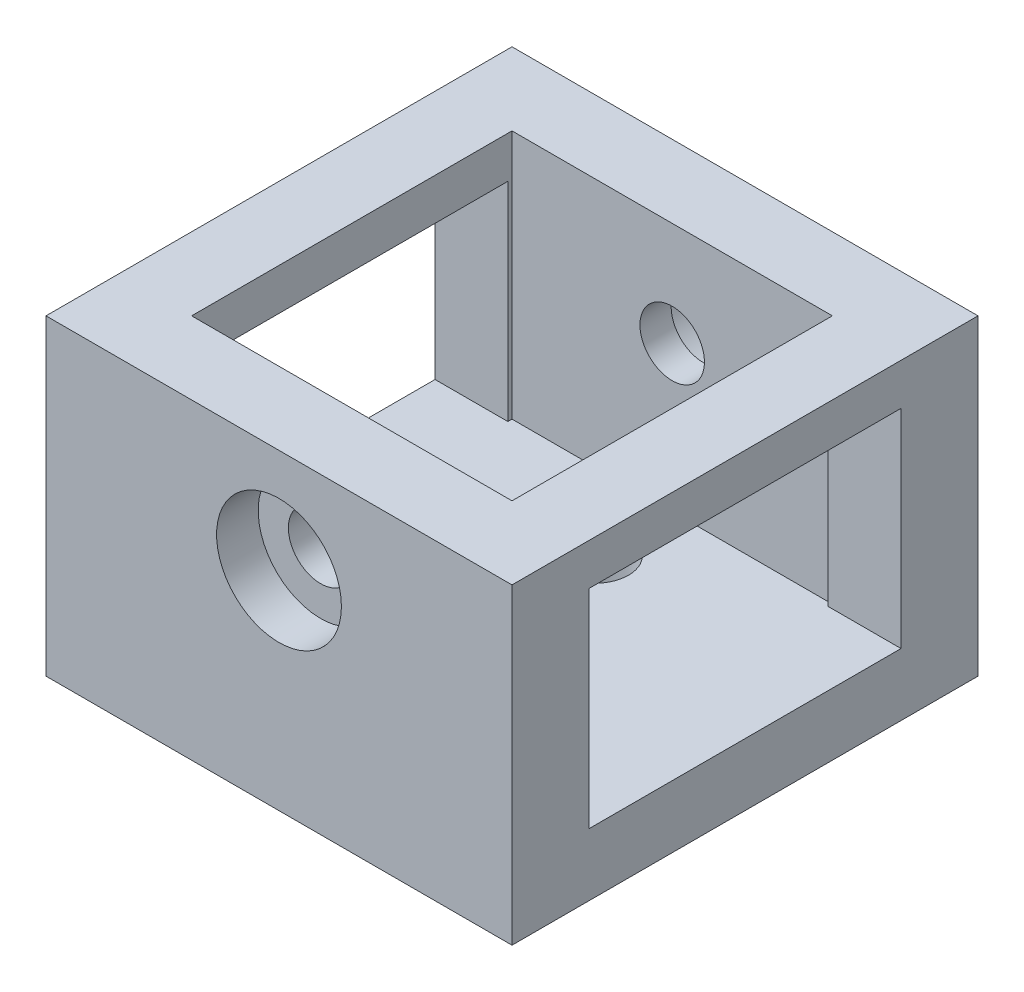
ISO-10303-21;
HEADER;
FILE_DESCRIPTION(('STEP AP214'),'2;1');
FILE_NAME('part.step','',(''),(''),'','','');
FILE_SCHEMA(('AUTOMOTIVE_DESIGN { 1 0 10303 214 1 1 1 1 }'));
ENDSEC;
DATA;
#1=APPLICATION_CONTEXT('core data for automotive mechanical design processes');
#2=APPLICATION_PROTOCOL_DEFINITION('international standard','automotive_design',2000,#1);
#3=PRODUCT_CONTEXT('',#1,'mechanical');
#4=PRODUCT('Part','Part','',(#3));
#5=PRODUCT_RELATED_PRODUCT_CATEGORY('part','',(#4));
#6=PRODUCT_DEFINITION_FORMATION('','',#4);
#7=PRODUCT_DEFINITION_CONTEXT('part definition',#1,'design');
#8=PRODUCT_DEFINITION('design','',#6,#7);
#9=PRODUCT_DEFINITION_SHAPE('','',#8);
#10=(LENGTH_UNIT() NAMED_UNIT(*) SI_UNIT(.MILLI.,.METRE.));
#11=(NAMED_UNIT(*) PLANE_ANGLE_UNIT() SI_UNIT($,.RADIAN.));
#12=(NAMED_UNIT(*) SI_UNIT($,.STERADIAN.) SOLID_ANGLE_UNIT());
#13=UNCERTAINTY_MEASURE_WITH_UNIT(LENGTH_MEASURE(1.E-05),#10,'distance_accuracy_value','');
#14=(GEOMETRIC_REPRESENTATION_CONTEXT(3) GLOBAL_UNCERTAINTY_ASSIGNED_CONTEXT((#13)) GLOBAL_UNIT_ASSIGNED_CONTEXT((#10,
#11,#12)) REPRESENTATION_CONTEXT('',''));
#15=CARTESIAN_POINT('',(0.,0.,0.));
#16=DIRECTION('',(0.,0.,1.));
#17=DIRECTION('',(1.,0.,0.));
#18=AXIS2_PLACEMENT_3D('',#15,#16,#17);
#19=CARTESIAN_POINT('',(0.,10.,11.2));
#20=DIRECTION('',(0.,0.,-1.));
#21=DIRECTION('',(-1.,0.,0.));
#22=AXIS2_PLACEMENT_3D('',#19,#20,#21);
#23=CYLINDRICAL_SURFACE('',#22,1.55);
#24=CARTESIAN_POINT('',(0.,10.,7.7));
#25=DIRECTION('',(0.,0.,1.));
#26=DIRECTION('',(1.,0.,0.));
#27=AXIS2_PLACEMENT_3D('',#24,#25,#26);
#28=CIRCLE('',#27,1.55);
#29=CARTESIAN_POINT('',(1.55,10.,7.7));
#30=VERTEX_POINT('',#29);
#31=EDGE_CURVE('E231',#30,#30,#28,.T.);
#32=ORIENTED_EDGE('',*,*,#31,.F.);
#33=EDGE_LOOP('',(#32));
#34=FACE_BOUND('',#33,.T.);
#35=CARTESIAN_POINT('',(0.,10.,9.2));
#36=DIRECTION('',(0.,0.,1.));
#37=DIRECTION('',(1.,0.,0.));
#38=AXIS2_PLACEMENT_3D('',#35,#36,#37);
#39=CIRCLE('',#38,1.55);
#40=CARTESIAN_POINT('',(1.55,10.,9.2));
#41=VERTEX_POINT('',#40);
#42=EDGE_CURVE('E40',#41,#41,#39,.F.);
#43=ORIENTED_EDGE('',*,*,#42,.F.);
#44=EDGE_LOOP('',(#43));
#45=FACE_BOUND('',#44,.T.);
#46=ADVANCED_FACE('F36',(#34,#45),#23,.F.);
#47=CARTESIAN_POINT('',(0.,10.,-7.7));
#48=DIRECTION('',(0.,0.,-1.));
#49=DIRECTION('',(-1.,0.,0.));
#50=AXIS2_PLACEMENT_3D('',#47,#48,#49);
#51=CIRCLE('',#50,1.55);
#52=CARTESIAN_POINT('',(-1.55,10.,-7.7));
#53=VERTEX_POINT('',#52);
#54=EDGE_CURVE('E228',#53,#53,#51,.T.);
#55=ORIENTED_EDGE('',*,*,#54,.F.);
#56=EDGE_LOOP('',(#55));
#57=FACE_BOUND('',#56,.T.);
#58=CARTESIAN_POINT('',(0.,10.,-9.2));
#59=DIRECTION('',(0.,0.,-1.));
#60=DIRECTION('',(-1.,0.,0.));
#61=AXIS2_PLACEMENT_3D('',#58,#59,#60);
#62=CIRCLE('',#61,1.55);
#63=CARTESIAN_POINT('',(-1.55,10.,-9.2));
#64=VERTEX_POINT('',#63);
#65=EDGE_CURVE('E216',#64,#64,#62,.F.);
#66=ORIENTED_EDGE('',*,*,#65,.F.);
#67=EDGE_LOOP('',(#66));
#68=FACE_BOUND('',#67,.T.);
#69=ADVANCED_FACE('F307',(#57,#68),#23,.F.);
#70=CARTESIAN_POINT('',(7.7,15.,0.));
#71=DIRECTION('',(1.,0.,0.));
#72=DIRECTION('',(0.,0.,-1.));
#73=AXIS2_PLACEMENT_3D('',#70,#71,#72);
#74=PLANE('',#73);
#75=DIRECTION('',(0.,0.,-1.));
#76=VECTOR('',#75,1.);
#77=CARTESIAN_POINT('',(7.7,3.,0.));
#78=LINE('',#77,#76);
#79=CARTESIAN_POINT('',(7.70000000000001,3.,-7.5));
#80=VERTEX_POINT('',#79);
#81=CARTESIAN_POINT('',(7.7,3.,-7.7));
#82=VERTEX_POINT('',#81);
#83=EDGE_CURVE('E294',#80,#82,#78,.T.);
#84=ORIENTED_EDGE('',*,*,#83,.F.);
#85=DIRECTION('',(0.,1.,0.));
#86=VECTOR('',#85,1.);
#87=CARTESIAN_POINT('',(7.70000000000001,15.,-7.5));
#88=LINE('',#87,#86);
#89=CARTESIAN_POINT('',(7.7,13.,-7.5));
#90=VERTEX_POINT('',#89);
#91=EDGE_CURVE('E200',#80,#90,#88,.T.);
#92=ORIENTED_EDGE('',*,*,#91,.T.);
#93=DIRECTION('',(0.,0.,1.));
#94=VECTOR('',#93,1.);
#95=CARTESIAN_POINT('',(7.7,13.,0.));
#96=LINE('',#95,#94);
#97=CARTESIAN_POINT('',(7.7,13.,7.5));
#98=VERTEX_POINT('',#97);
#99=EDGE_CURVE('E205',#90,#98,#96,.T.);
#100=ORIENTED_EDGE('',*,*,#99,.T.);
#101=DIRECTION('',(0.,-1.,0.));
#102=VECTOR('',#101,1.);
#103=CARTESIAN_POINT('',(7.7,15.,7.5));
#104=LINE('',#103,#102);
#105=CARTESIAN_POINT('',(7.7,3.,7.5));
#106=VERTEX_POINT('',#105);
#107=EDGE_CURVE('E152',#98,#106,#104,.T.);
#108=ORIENTED_EDGE('',*,*,#107,.T.);
#109=CARTESIAN_POINT('',(7.7,3.,7.7));
#110=VERTEX_POINT('',#109);
#111=EDGE_CURVE('E295',#110,#106,#78,.T.);
#112=ORIENTED_EDGE('',*,*,#111,.F.);
#113=DIRECTION('',(0.,-1.,0.));
#114=VECTOR('',#113,1.);
#115=CARTESIAN_POINT('',(7.7,15.,7.7));
#116=LINE('',#115,#114);
#117=CARTESIAN_POINT('',(7.7,15.,7.7));
#118=VERTEX_POINT('',#117);
#119=EDGE_CURVE('E272',#118,#110,#116,.T.);
#120=ORIENTED_EDGE('',*,*,#119,.F.);
#121=DIRECTION('',(0.,0.,1.));
#122=VECTOR('',#121,1.);
#123=CARTESIAN_POINT('',(7.7,15.,0.));
#124=LINE('',#123,#122);
#125=CARTESIAN_POINT('',(7.7,15.,-7.7));
#126=VERTEX_POINT('',#125);
#127=EDGE_CURVE('E248',#126,#118,#124,.T.);
#128=ORIENTED_EDGE('',*,*,#127,.F.);
#129=DIRECTION('',(0.,-1.,0.));
#130=VECTOR('',#129,1.);
#131=CARTESIAN_POINT('',(7.7,15.,-7.7));
#132=LINE('',#131,#130);
#133=EDGE_CURVE('E263',#126,#82,#132,.T.);
#134=ORIENTED_EDGE('',*,*,#133,.T.);
#135=EDGE_LOOP('',(#84,#92,#100,#108,#112,#120,#128,#134));
#136=FACE_BOUND('',#135,.T.);
#137=ADVANCED_FACE('F309',(#136),#74,.F.);
#138=CARTESIAN_POINT('',(0.,15.,7.7));
#139=DIRECTION('',(0.,0.,1.));
#140=DIRECTION('',(1.,0.,0.));
#141=AXIS2_PLACEMENT_3D('',#138,#139,#140);
#142=PLANE('',#141);
#143=ORIENTED_EDGE('',*,*,#31,.T.);
#144=EDGE_LOOP('',(#143));
#145=FACE_BOUND('',#144,.T.);
#146=ORIENTED_EDGE('',*,*,#119,.T.);
#147=DIRECTION('',(1.,0.,0.));
#148=VECTOR('',#147,1.);
#149=CARTESIAN_POINT('',(0.,3.,7.7));
#150=LINE('',#149,#148);
#151=CARTESIAN_POINT('',(-7.7,3.,7.7));
#152=VERTEX_POINT('',#151);
#153=EDGE_CURVE('E291',#152,#110,#150,.T.);
#154=ORIENTED_EDGE('',*,*,#153,.F.);
#155=DIRECTION('',(0.,-1.,0.));
#156=VECTOR('',#155,1.);
#157=CARTESIAN_POINT('',(-7.7,15.,7.7));
#158=LINE('',#157,#156);
#159=CARTESIAN_POINT('',(-7.7,15.,7.7));
#160=VERTEX_POINT('',#159);
#161=EDGE_CURVE('E270',#160,#152,#158,.T.);
#162=ORIENTED_EDGE('',*,*,#161,.F.);
#163=DIRECTION('',(-1.,0.,0.));
#164=VECTOR('',#163,1.);
#165=CARTESIAN_POINT('',(0.,15.,7.7));
#166=LINE('',#165,#164);
#167=EDGE_CURVE('E251',#118,#160,#166,.T.);
#168=ORIENTED_EDGE('',*,*,#167,.F.);
#169=EDGE_LOOP('',(#146,#154,#162,#168));
#170=FACE_BOUND('',#169,.T.);
#171=ADVANCED_FACE('F316',(#145,#170),#142,.F.);
#172=CARTESIAN_POINT('',(-7.7,15.,0.));
#173=DIRECTION('',(1.,0.,0.));
#174=DIRECTION('',(0.,0.,-1.));
#175=AXIS2_PLACEMENT_3D('',#172,#173,#174);
#176=PLANE('',#175);
#177=DIRECTION('',(0.,1.,0.));
#178=VECTOR('',#177,1.);
#179=CARTESIAN_POINT('',(-7.7,15.,-7.5));
#180=LINE('',#179,#178);
#181=CARTESIAN_POINT('',(-7.7,3.,-7.5));
#182=VERTEX_POINT('',#181);
#183=CARTESIAN_POINT('',(-7.7,13.,-7.5));
#184=VERTEX_POINT('',#183);
#185=EDGE_CURVE('E198',#182,#184,#180,.T.);
#186=ORIENTED_EDGE('',*,*,#185,.F.);
#187=DIRECTION('',(0.,0.,-1.));
#188=VECTOR('',#187,1.);
#189=CARTESIAN_POINT('',(-7.7,3.,0.));
#190=LINE('',#189,#188);
#191=CARTESIAN_POINT('',(-7.7,3.,-7.7));
#192=VERTEX_POINT('',#191);
#193=EDGE_CURVE('E287',#182,#192,#190,.T.);
#194=ORIENTED_EDGE('',*,*,#193,.T.);
#195=DIRECTION('',(0.,-1.,0.));
#196=VECTOR('',#195,1.);
#197=CARTESIAN_POINT('',(-7.7,15.,-7.7));
#198=LINE('',#197,#196);
#199=CARTESIAN_POINT('',(-7.7,15.,-7.7));
#200=VERTEX_POINT('',#199);
#201=EDGE_CURVE('E266',#200,#192,#198,.T.);
#202=ORIENTED_EDGE('',*,*,#201,.F.);
#203=DIRECTION('',(0.,0.,1.));
#204=VECTOR('',#203,1.);
#205=CARTESIAN_POINT('',(-7.7,15.,0.));
#206=LINE('',#205,#204);
#207=EDGE_CURVE('E253',#200,#160,#206,.T.);
#208=ORIENTED_EDGE('',*,*,#207,.T.);
#209=ORIENTED_EDGE('',*,*,#161,.T.);
#210=CARTESIAN_POINT('',(-7.7,3.,7.5));
#211=VERTEX_POINT('',#210);
#212=EDGE_CURVE('E288',#152,#211,#190,.T.);
#213=ORIENTED_EDGE('',*,*,#212,.T.);
#214=DIRECTION('',(0.,-1.,0.));
#215=VECTOR('',#214,1.);
#216=CARTESIAN_POINT('',(-7.7,15.,7.5));
#217=LINE('',#216,#215);
#218=CARTESIAN_POINT('',(-7.7,13.,7.5));
#219=VERTEX_POINT('',#218);
#220=EDGE_CURVE('E190',#219,#211,#217,.T.);
#221=ORIENTED_EDGE('',*,*,#220,.F.);
#222=DIRECTION('',(0.,0.,1.));
#223=VECTOR('',#222,1.);
#224=CARTESIAN_POINT('',(-7.7,13.,0.));
#225=LINE('',#224,#223);
#226=EDGE_CURVE('E203',#184,#219,#225,.T.);
#227=ORIENTED_EDGE('',*,*,#226,.F.);
#228=EDGE_LOOP('',(#186,#194,#202,#208,#209,#213,#221,#227));
#229=FACE_BOUND('',#228,.T.);
#230=ADVANCED_FACE('F334',(#229),#176,.T.);
#231=CARTESIAN_POINT('',(11.2,15.,0.));
#232=DIRECTION('',(1.,0.,0.));
#233=DIRECTION('',(0.,0.,-1.));
#234=AXIS2_PLACEMENT_3D('',#231,#232,#233);
#235=PLANE('',#234);
#236=DIRECTION('',(0.,-1.,0.));
#237=VECTOR('',#236,1.);
#238=CARTESIAN_POINT('',(11.2,3.,-7.5));
#239=LINE('',#238,#237);
#240=CARTESIAN_POINT('',(11.2,13.,-7.5));
#241=VERTEX_POINT('',#240);
#242=CARTESIAN_POINT('',(11.2,3.,-7.5));
#243=VERTEX_POINT('',#242);
#244=EDGE_CURVE('E166',#241,#243,#239,.T.);
#245=ORIENTED_EDGE('',*,*,#244,.T.);
#246=DIRECTION('',(0.,0.,1.));
#247=VECTOR('',#246,1.);
#248=CARTESIAN_POINT('',(11.2,3.,-7.5));
#249=LINE('',#248,#247);
#250=CARTESIAN_POINT('',(11.2,3.,7.5));
#251=VERTEX_POINT('',#250);
#252=EDGE_CURVE('E172',#243,#251,#249,.T.);
#253=ORIENTED_EDGE('',*,*,#252,.T.);
#254=DIRECTION('',(0.,1.,0.));
#255=VECTOR('',#254,1.);
#256=CARTESIAN_POINT('',(11.2,10.,7.5));
#257=LINE('',#256,#255);
#258=CARTESIAN_POINT('',(11.2,13.,7.5));
#259=VERTEX_POINT('',#258);
#260=EDGE_CURVE('E53',#251,#259,#257,.T.);
#261=ORIENTED_EDGE('',*,*,#260,.T.);
#262=DIRECTION('',(0.,0.,-1.));
#263=VECTOR('',#262,1.);
#264=CARTESIAN_POINT('',(11.2,13.,-7.5));
#265=LINE('',#264,#263);
#266=EDGE_CURVE('E159',#259,#241,#265,.T.);
#267=ORIENTED_EDGE('',*,*,#266,.T.);
#268=EDGE_LOOP('',(#245,#253,#261,#267));
#269=FACE_BOUND('',#268,.T.);
#270=DIRECTION('',(0.,0.,1.));
#271=VECTOR('',#270,1.);
#272=CARTESIAN_POINT('',(11.2,0.,0.));
#273=LINE('',#272,#271);
#274=CARTESIAN_POINT('',(11.2,0.,-11.2));
#275=VERTEX_POINT('',#274);
#276=CARTESIAN_POINT('',(11.2,0.,11.2));
#277=VERTEX_POINT('',#276);
#278=EDGE_CURVE('E234',#275,#277,#273,.T.);
#279=ORIENTED_EDGE('',*,*,#278,.F.);
#280=DIRECTION('',(0.,-1.,0.));
#281=VECTOR('',#280,1.);
#282=CARTESIAN_POINT('',(11.2,15.,-11.2));
#283=LINE('',#282,#281);
#284=CARTESIAN_POINT('',(11.2,15.,-11.2));
#285=VERTEX_POINT('',#284);
#286=EDGE_CURVE('E280',#285,#275,#283,.T.);
#287=ORIENTED_EDGE('',*,*,#286,.F.);
#288=DIRECTION('',(0.,0.,1.));
#289=VECTOR('',#288,1.);
#290=CARTESIAN_POINT('',(11.2,15.,0.));
#291=LINE('',#290,#289);
#292=CARTESIAN_POINT('',(11.2,15.,11.2));
#293=VERTEX_POINT('',#292);
#294=EDGE_CURVE('E238',#285,#293,#291,.T.);
#295=ORIENTED_EDGE('',*,*,#294,.T.);
#296=DIRECTION('',(0.,-1.,0.));
#297=VECTOR('',#296,1.);
#298=CARTESIAN_POINT('',(11.2,15.,11.2));
#299=LINE('',#298,#297);
#300=EDGE_CURVE('E267',#293,#277,#299,.T.);
#301=ORIENTED_EDGE('',*,*,#300,.T.);
#302=EDGE_LOOP('',(#279,#287,#295,#301));
#303=FACE_BOUND('',#302,.T.);
#304=ADVANCED_FACE('F169',(#269,#303),#235,.T.);
#305=CARTESIAN_POINT('',(-11.2,15.,0.));
#306=DIRECTION('',(-1.,0.,0.));
#307=DIRECTION('',(0.,0.,1.));
#308=AXIS2_PLACEMENT_3D('',#305,#306,#307);
#309=PLANE('',#308);
#310=DIRECTION('',(0.,-1.,0.));
#311=VECTOR('',#310,1.);
#312=CARTESIAN_POINT('',(-11.2,3.,-7.5));
#313=LINE('',#312,#311);
#314=CARTESIAN_POINT('',(-11.2,13.,-7.5));
#315=VERTEX_POINT('',#314);
#316=CARTESIAN_POINT('',(-11.2,3.,-7.5));
#317=VERTEX_POINT('',#316);
#318=EDGE_CURVE('E61',#315,#317,#313,.T.);
#319=ORIENTED_EDGE('',*,*,#318,.F.);
#320=DIRECTION('',(0.,0.,-1.));
#321=VECTOR('',#320,1.);
#322=CARTESIAN_POINT('',(-11.2,13.,-7.5));
#323=LINE('',#322,#321);
#324=CARTESIAN_POINT('',(-11.2,13.,7.5));
#325=VERTEX_POINT('',#324);
#326=EDGE_CURVE('E184',#325,#315,#323,.T.);
#327=ORIENTED_EDGE('',*,*,#326,.F.);
#328=DIRECTION('',(0.,1.,0.));
#329=VECTOR('',#328,1.);
#330=CARTESIAN_POINT('',(-11.2,10.,7.5));
#331=LINE('',#330,#329);
#332=CARTESIAN_POINT('',(-11.2,3.,7.5));
#333=VERTEX_POINT('',#332);
#334=EDGE_CURVE('E181',#333,#325,#331,.T.);
#335=ORIENTED_EDGE('',*,*,#334,.F.);
#336=DIRECTION('',(0.,0.,1.));
#337=VECTOR('',#336,1.);
#338=CARTESIAN_POINT('',(-11.2,3.,0.));
#339=LINE('',#338,#337);
#340=EDGE_CURVE('E178',#317,#333,#339,.T.);
#341=ORIENTED_EDGE('',*,*,#340,.F.);
#342=EDGE_LOOP('',(#319,#327,#335,#341));
#343=FACE_BOUND('',#342,.T.);
#344=DIRECTION('',(0.,0.,-1.));
#345=VECTOR('',#344,1.);
#346=CARTESIAN_POINT('',(-11.2,0.,0.));
#347=LINE('',#346,#345);
#348=CARTESIAN_POINT('',(-11.2,0.,11.2));
#349=VERTEX_POINT('',#348);
#350=CARTESIAN_POINT('',(-11.2,0.,-11.2));
#351=VERTEX_POINT('',#350);
#352=EDGE_CURVE('E239',#349,#351,#347,.T.);
#353=ORIENTED_EDGE('',*,*,#352,.F.);
#354=DIRECTION('',(0.,-1.,0.));
#355=VECTOR('',#354,1.);
#356=CARTESIAN_POINT('',(-11.2,15.,11.2));
#357=LINE('',#356,#355);
#358=CARTESIAN_POINT('',(-11.2,15.,11.2));
#359=VERTEX_POINT('',#358);
#360=EDGE_CURVE('E258',#359,#349,#357,.T.);
#361=ORIENTED_EDGE('',*,*,#360,.F.);
#362=DIRECTION('',(0.,0.,-1.));
#363=VECTOR('',#362,1.);
#364=CARTESIAN_POINT('',(-11.2,15.,0.));
#365=LINE('',#364,#363);
#366=CARTESIAN_POINT('',(-11.2,15.,-11.2));
#367=VERTEX_POINT('',#366);
#368=EDGE_CURVE('E245',#359,#367,#365,.T.);
#369=ORIENTED_EDGE('',*,*,#368,.T.);
#370=DIRECTION('',(0.,-1.,0.));
#371=VECTOR('',#370,1.);
#372=CARTESIAN_POINT('',(-11.2,15.,-11.2));
#373=LINE('',#372,#371);
#374=EDGE_CURVE('E277',#367,#351,#373,.T.);
#375=ORIENTED_EDGE('',*,*,#374,.T.);
#376=EDGE_LOOP('',(#353,#361,#369,#375));
#377=FACE_BOUND('',#376,.T.);
#378=ADVANCED_FACE('F332',(#343,#377),#309,.T.);
#379=CARTESIAN_POINT('',(0.,15.,-7.7));
#380=DIRECTION('',(0.,0.,-1.));
#381=DIRECTION('',(-1.,0.,0.));
#382=AXIS2_PLACEMENT_3D('',#379,#380,#381);
#383=PLANE('',#382);
#384=ORIENTED_EDGE('',*,*,#54,.T.);
#385=EDGE_LOOP('',(#384));
#386=FACE_BOUND('',#385,.T.);
#387=ORIENTED_EDGE('',*,*,#201,.T.);
#388=DIRECTION('',(-1.,0.,0.));
#389=VECTOR('',#388,1.);
#390=CARTESIAN_POINT('',(0.,3.,-7.7));
#391=LINE('',#390,#389);
#392=EDGE_CURVE('E274',#82,#192,#391,.T.);
#393=ORIENTED_EDGE('',*,*,#392,.F.);
#394=ORIENTED_EDGE('',*,*,#133,.F.);
#395=DIRECTION('',(1.,0.,0.));
#396=VECTOR('',#395,1.);
#397=CARTESIAN_POINT('',(0.,15.,-7.7));
#398=LINE('',#397,#396);
#399=EDGE_CURVE('E256',#200,#126,#398,.T.);
#400=ORIENTED_EDGE('',*,*,#399,.F.);
#401=EDGE_LOOP('',(#387,#393,#394,#400));
#402=FACE_BOUND('',#401,.T.);
#403=ADVANCED_FACE('F328',(#386,#402),#383,.F.);
#404=CARTESIAN_POINT('',(0.,15.,0.));
#405=DIRECTION('',(0.,1.,0.));
#406=DIRECTION('',(0.,0.,1.));
#407=AXIS2_PLACEMENT_3D('',#404,#405,#406);
#408=PLANE('',#407);
#409=DIRECTION('',(-1.,0.,0.));
#410=VECTOR('',#409,1.);
#411=CARTESIAN_POINT('',(0.,15.,11.2));
#412=LINE('',#411,#410);
#413=EDGE_CURVE('E235',#293,#359,#412,.T.);
#414=ORIENTED_EDGE('',*,*,#413,.F.);
#415=ORIENTED_EDGE('',*,*,#294,.F.);
#416=DIRECTION('',(1.,0.,0.));
#417=VECTOR('',#416,1.);
#418=CARTESIAN_POINT('',(0.,15.,-11.2));
#419=LINE('',#418,#417);
#420=EDGE_CURVE('E242',#367,#285,#419,.T.);
#421=ORIENTED_EDGE('',*,*,#420,.F.);
#422=ORIENTED_EDGE('',*,*,#368,.F.);
#423=EDGE_LOOP('',(#414,#415,#421,#422));
#424=FACE_BOUND('',#423,.T.);
#425=ORIENTED_EDGE('',*,*,#127,.T.);
#426=ORIENTED_EDGE('',*,*,#167,.T.);
#427=ORIENTED_EDGE('',*,*,#207,.F.);
#428=ORIENTED_EDGE('',*,*,#399,.T.);
#429=EDGE_LOOP('',(#425,#426,#427,#428));
#430=FACE_BOUND('',#429,.T.);
#431=ADVANCED_FACE('F325',(#424,#430),#408,.T.);
#432=CARTESIAN_POINT('',(0.,3.,11.2));
#433=DIRECTION('',(0.,0.,1.));
#434=DIRECTION('',(1.,0.,0.));
#435=AXIS2_PLACEMENT_3D('',#432,#433,#434);
#436=PLANE('',#435);
#437=CARTESIAN_POINT('',(0.,10.,11.2));
#438=DIRECTION('',(0.,0.,1.));
#439=DIRECTION('',(1.,0.,0.));
#440=AXIS2_PLACEMENT_3D('',#437,#438,#439);
#441=CIRCLE('',#440,3.);
#442=CARTESIAN_POINT('',(3.,10.,11.2));
#443=VERTEX_POINT('',#442);
#444=EDGE_CURVE('E207',#443,#443,#441,.T.);
#445=ORIENTED_EDGE('',*,*,#444,.F.);
#446=EDGE_LOOP('',(#445));
#447=FACE_BOUND('',#446,.T.);
#448=ORIENTED_EDGE('',*,*,#360,.T.);
#449=DIRECTION('',(-1.,0.,0.));
#450=VECTOR('',#449,1.);
#451=CARTESIAN_POINT('',(0.,0.,11.2));
#452=LINE('',#451,#450);
#453=EDGE_CURVE('E45',#277,#349,#452,.T.);
#454=ORIENTED_EDGE('',*,*,#453,.F.);
#455=ORIENTED_EDGE('',*,*,#300,.F.);
#456=ORIENTED_EDGE('',*,*,#413,.T.);
#457=EDGE_LOOP('',(#448,#454,#455,#456));
#458=FACE_BOUND('',#457,.T.);
#459=ADVANCED_FACE('F38',(#447,#458),#436,.T.);
#460=CARTESIAN_POINT('',(0.,3.,-11.2));
#461=DIRECTION('',(0.,0.,-1.));
#462=DIRECTION('',(-1.,0.,0.));
#463=AXIS2_PLACEMENT_3D('',#460,#461,#462);
#464=PLANE('',#463);
#465=CARTESIAN_POINT('',(0.,10.,-11.2));
#466=DIRECTION('',(0.,0.,-1.));
#467=DIRECTION('',(-1.,0.,0.));
#468=AXIS2_PLACEMENT_3D('',#465,#466,#467);
#469=CIRCLE('',#468,3.);
#470=CARTESIAN_POINT('',(-3.,10.,-11.2));
#471=VERTEX_POINT('',#470);
#472=EDGE_CURVE('E217',#471,#471,#469,.T.);
#473=ORIENTED_EDGE('',*,*,#472,.F.);
#474=EDGE_LOOP('',(#473));
#475=FACE_BOUND('',#474,.T.);
#476=ORIENTED_EDGE('',*,*,#286,.T.);
#477=DIRECTION('',(1.,0.,0.));
#478=VECTOR('',#477,1.);
#479=CARTESIAN_POINT('',(0.,0.,-11.2));
#480=LINE('',#479,#478);
#481=EDGE_CURVE('E11',#351,#275,#480,.T.);
#482=ORIENTED_EDGE('',*,*,#481,.F.);
#483=ORIENTED_EDGE('',*,*,#374,.F.);
#484=ORIENTED_EDGE('',*,*,#420,.T.);
#485=EDGE_LOOP('',(#476,#482,#483,#484));
#486=FACE_BOUND('',#485,.T.);
#487=ADVANCED_FACE('F352',(#475,#486),#464,.T.);
#488=CARTESIAN_POINT('',(0.,0.,0.));
#489=DIRECTION('',(0.,1.,0.));
#490=DIRECTION('',(0.,0.,1.));
#491=AXIS2_PLACEMENT_3D('',#488,#489,#490);
#492=PLANE('',#491);
#493=CARTESIAN_POINT('',(0.,0.,-4.));
#494=DIRECTION('',(0.,-1.,0.));
#495=DIRECTION('',(0.,0.,-1.));
#496=AXIS2_PLACEMENT_3D('',#493,#494,#495);
#497=CIRCLE('',#496,1.6);
#498=CARTESIAN_POINT('',(0.,0.,-5.6));
#499=VERTEX_POINT('',#498);
#500=EDGE_CURVE('E220',#499,#499,#497,.T.);
#501=ORIENTED_EDGE('',*,*,#500,.F.);
#502=EDGE_LOOP('',(#501));
#503=FACE_BOUND('',#502,.T.);
#504=CARTESIAN_POINT('',(0.,0.,4.));
#505=DIRECTION('',(0.,-1.,0.));
#506=DIRECTION('',(0.,0.,-1.));
#507=AXIS2_PLACEMENT_3D('',#504,#505,#506);
#508=CIRCLE('',#507,1.6);
#509=CARTESIAN_POINT('',(0.,0.,2.4));
#510=VERTEX_POINT('',#509);
#511=EDGE_CURVE('E224',#510,#510,#508,.T.);
#512=ORIENTED_EDGE('',*,*,#511,.F.);
#513=EDGE_LOOP('',(#512));
#514=FACE_BOUND('',#513,.T.);
#515=ORIENTED_EDGE('',*,*,#481,.T.);
#516=ORIENTED_EDGE('',*,*,#278,.T.);
#517=ORIENTED_EDGE('',*,*,#453,.T.);
#518=ORIENTED_EDGE('',*,*,#352,.T.);
#519=EDGE_LOOP('',(#515,#516,#517,#518));
#520=FACE_BOUND('',#519,.T.);
#521=ADVANCED_FACE('F349',(#503,#514,#520),#492,.F.);
#522=CARTESIAN_POINT('',(0.,3.,0.));
#523=DIRECTION('',(0.,1.,0.));
#524=DIRECTION('',(0.,0.,1.));
#525=AXIS2_PLACEMENT_3D('',#522,#523,#524);
#526=PLANE('',#525);
#527=ORIENTED_EDGE('',*,*,#111,.T.);
#528=DIRECTION('',(-1.,0.,0.));
#529=VECTOR('',#528,1.);
#530=CARTESIAN_POINT('',(11.2,3.,7.5));
#531=LINE('',#530,#529);
#532=EDGE_CURVE('E193',#251,#106,#531,.T.);
#533=ORIENTED_EDGE('',*,*,#532,.F.);
#534=ORIENTED_EDGE('',*,*,#252,.F.);
#535=DIRECTION('',(-1.,0.,0.));
#536=VECTOR('',#535,1.);
#537=CARTESIAN_POINT('',(11.2,3.,-7.5));
#538=LINE('',#537,#536);
#539=EDGE_CURVE('E188',#243,#80,#538,.T.);
#540=ORIENTED_EDGE('',*,*,#539,.T.);
#541=ORIENTED_EDGE('',*,*,#83,.T.);
#542=ORIENTED_EDGE('',*,*,#392,.T.);
#543=ORIENTED_EDGE('',*,*,#193,.F.);
#544=EDGE_CURVE('E191',#182,#317,#538,.T.);
#545=ORIENTED_EDGE('',*,*,#544,.T.);
#546=ORIENTED_EDGE('',*,*,#340,.T.);
#547=EDGE_CURVE('E177',#211,#333,#531,.T.);
#548=ORIENTED_EDGE('',*,*,#547,.F.);
#549=ORIENTED_EDGE('',*,*,#212,.F.);
#550=ORIENTED_EDGE('',*,*,#153,.T.);
#551=EDGE_LOOP('',(#527,#533,#534,#540,#541,#542,#543,#545,#546,#548,#549,#550));
#552=FACE_BOUND('',#551,.T.);
#553=CARTESIAN_POINT('',(0.,3.,-4.));
#554=DIRECTION('',(0.,1.,0.));
#555=DIRECTION('',(0.,0.,1.));
#556=AXIS2_PLACEMENT_3D('',#553,#554,#555);
#557=CIRCLE('',#556,1.6);
#558=CARTESIAN_POINT('',(0.,3.,-2.4));
#559=VERTEX_POINT('',#558);
#560=EDGE_CURVE('E223',#559,#559,#557,.T.);
#561=ORIENTED_EDGE('',*,*,#560,.F.);
#562=EDGE_LOOP('',(#561));
#563=FACE_BOUND('',#562,.T.);
#564=CARTESIAN_POINT('',(0.,3.,4.));
#565=DIRECTION('',(0.,1.,0.));
#566=DIRECTION('',(0.,0.,1.));
#567=AXIS2_PLACEMENT_3D('',#564,#565,#566);
#568=CIRCLE('',#567,1.6);
#569=CARTESIAN_POINT('',(0.,3.,5.6));
#570=VERTEX_POINT('',#569);
#571=EDGE_CURVE('E227',#570,#570,#568,.T.);
#572=ORIENTED_EDGE('',*,*,#571,.F.);
#573=EDGE_LOOP('',(#572));
#574=FACE_BOUND('',#573,.T.);
#575=ADVANCED_FACE('F346',(#552,#563,#574),#526,.T.);
#576=CARTESIAN_POINT('',(0.,15.,4.));
#577=DIRECTION('',(0.,-1.,0.));
#578=DIRECTION('',(0.,0.,-1.));
#579=AXIS2_PLACEMENT_3D('',#576,#577,#578);
#580=CYLINDRICAL_SURFACE('',#579,1.6);
#581=ORIENTED_EDGE('',*,*,#571,.T.);
#582=EDGE_LOOP('',(#581));
#583=FACE_BOUND('',#582,.T.);
#584=ORIENTED_EDGE('',*,*,#511,.T.);
#585=EDGE_LOOP('',(#584));
#586=FACE_BOUND('',#585,.T.);
#587=ADVANCED_FACE('F323',(#583,#586),#580,.F.);
#588=CARTESIAN_POINT('',(0.,15.,-4.));
#589=DIRECTION('',(0.,-1.,0.));
#590=DIRECTION('',(0.,0.,-1.));
#591=AXIS2_PLACEMENT_3D('',#588,#589,#590);
#592=CYLINDRICAL_SURFACE('',#591,1.6);
#593=ORIENTED_EDGE('',*,*,#560,.T.);
#594=EDGE_LOOP('',(#593));
#595=FACE_BOUND('',#594,.T.);
#596=ORIENTED_EDGE('',*,*,#500,.T.);
#597=EDGE_LOOP('',(#596));
#598=FACE_BOUND('',#597,.T.);
#599=ADVANCED_FACE('F430',(#595,#598),#592,.F.);
#600=CARTESIAN_POINT('',(0.,10.,-9.2));
#601=DIRECTION('',(0.,0.,-1.));
#602=DIRECTION('',(-1.,0.,0.));
#603=AXIS2_PLACEMENT_3D('',#600,#601,#602);
#604=PLANE('',#603);
#605=CARTESIAN_POINT('',(0.,10.,-9.2));
#606=DIRECTION('',(0.,0.,-1.));
#607=DIRECTION('',(-1.,0.,0.));
#608=AXIS2_PLACEMENT_3D('',#605,#606,#607);
#609=CIRCLE('',#608,3.);
#610=CARTESIAN_POINT('',(-3.,10.,-9.2));
#611=VERTEX_POINT('',#610);
#612=EDGE_CURVE('E213',#611,#611,#609,.T.);
#613=ORIENTED_EDGE('',*,*,#612,.T.);
#614=EDGE_LOOP('',(#613));
#615=FACE_BOUND('',#614,.T.);
#616=ORIENTED_EDGE('',*,*,#65,.T.);
#617=EDGE_LOOP('',(#616));
#618=FACE_BOUND('',#617,.T.);
#619=ADVANCED_FACE('F305',(#615,#618),#604,.T.);
#620=CARTESIAN_POINT('',(0.,10.,-9.2));
#621=DIRECTION('',(0.,0.,-1.));
#622=DIRECTION('',(-1.,0.,0.));
#623=AXIS2_PLACEMENT_3D('',#620,#621,#622);
#624=CYLINDRICAL_SURFACE('',#623,3.);
#625=ORIENTED_EDGE('',*,*,#612,.F.);
#626=EDGE_LOOP('',(#625));
#627=FACE_BOUND('',#626,.T.);
#628=ORIENTED_EDGE('',*,*,#472,.T.);
#629=EDGE_LOOP('',(#628));
#630=FACE_BOUND('',#629,.T.);
#631=ADVANCED_FACE('F425',(#627,#630),#624,.F.);
#632=CARTESIAN_POINT('',(0.,10.,9.2));
#633=DIRECTION('',(0.,0.,1.));
#634=DIRECTION('',(1.,0.,0.));
#635=AXIS2_PLACEMENT_3D('',#632,#633,#634);
#636=PLANE('',#635);
#637=CARTESIAN_POINT('',(0.,10.,9.2));
#638=DIRECTION('',(0.,0.,1.));
#639=DIRECTION('',(1.,0.,0.));
#640=AXIS2_PLACEMENT_3D('',#637,#638,#639);
#641=CIRCLE('',#640,3.);
#642=CARTESIAN_POINT('',(3.,10.,9.2));
#643=VERTEX_POINT('',#642);
#644=EDGE_CURVE('E208',#643,#643,#641,.T.);
#645=ORIENTED_EDGE('',*,*,#644,.T.);
#646=EDGE_LOOP('',(#645));
#647=FACE_BOUND('',#646,.T.);
#648=ORIENTED_EDGE('',*,*,#42,.T.);
#649=EDGE_LOOP('',(#648));
#650=FACE_BOUND('',#649,.T.);
#651=ADVANCED_FACE('F420',(#647,#650),#636,.T.);
#652=CARTESIAN_POINT('',(0.,10.,9.2));
#653=DIRECTION('',(0.,0.,1.));
#654=DIRECTION('',(1.,0.,0.));
#655=AXIS2_PLACEMENT_3D('',#652,#653,#654);
#656=CYLINDRICAL_SURFACE('',#655,3.);
#657=ORIENTED_EDGE('',*,*,#644,.F.);
#658=EDGE_LOOP('',(#657));
#659=FACE_BOUND('',#658,.T.);
#660=ORIENTED_EDGE('',*,*,#444,.T.);
#661=EDGE_LOOP('',(#660));
#662=FACE_BOUND('',#661,.T.);
#663=ADVANCED_FACE('F416',(#659,#662),#656,.F.);
#664=CARTESIAN_POINT('',(11.2,10.,7.5));
#665=DIRECTION('',(0.,0.,1.));
#666=DIRECTION('',(1.,0.,0.));
#667=AXIS2_PLACEMENT_3D('',#664,#665,#666);
#668=PLANE('',#667);
#669=ORIENTED_EDGE('',*,*,#220,.T.);
#670=ORIENTED_EDGE('',*,*,#547,.T.);
#671=ORIENTED_EDGE('',*,*,#334,.T.);
#672=DIRECTION('',(-1.,0.,0.));
#673=VECTOR('',#672,1.);
#674=CARTESIAN_POINT('',(11.2,13.,7.5));
#675=LINE('',#674,#673);
#676=EDGE_CURVE('E156',#219,#325,#675,.T.);
#677=ORIENTED_EDGE('',*,*,#676,.F.);
#678=EDGE_LOOP('',(#669,#670,#671,#677));
#679=FACE_BOUND('',#678,.T.);
#680=ADVANCED_FACE('F399',(#679),#668,.F.);
#681=CARTESIAN_POINT('',(11.2,13.,-7.5));
#682=DIRECTION('',(0.,1.,0.));
#683=DIRECTION('',(0.,0.,1.));
#684=AXIS2_PLACEMENT_3D('',#681,#682,#683);
#685=PLANE('',#684);
#686=ORIENTED_EDGE('',*,*,#226,.T.);
#687=ORIENTED_EDGE('',*,*,#676,.T.);
#688=ORIENTED_EDGE('',*,*,#326,.T.);
#689=DIRECTION('',(-1.,0.,0.));
#690=VECTOR('',#689,1.);
#691=CARTESIAN_POINT('',(11.2,13.,-7.5));
#692=LINE('',#691,#690);
#693=EDGE_CURVE('E155',#184,#315,#692,.T.);
#694=ORIENTED_EDGE('',*,*,#693,.F.);
#695=EDGE_LOOP('',(#686,#687,#688,#694));
#696=FACE_BOUND('',#695,.T.);
#697=ADVANCED_FACE('F401',(#696),#685,.F.);
#698=CARTESIAN_POINT('',(11.2,3.,-7.5));
#699=DIRECTION('',(0.,0.,-1.));
#700=DIRECTION('',(-1.,0.,0.));
#701=AXIS2_PLACEMENT_3D('',#698,#699,#700);
#702=PLANE('',#701);
#703=ORIENTED_EDGE('',*,*,#185,.T.);
#704=ORIENTED_EDGE('',*,*,#693,.T.);
#705=ORIENTED_EDGE('',*,*,#318,.T.);
#706=ORIENTED_EDGE('',*,*,#544,.F.);
#707=EDGE_LOOP('',(#703,#704,#705,#706));
#708=FACE_BOUND('',#707,.T.);
#709=ADVANCED_FACE('F393',(#708),#702,.F.);
#710=EDGE_CURVE('E162',#241,#90,#692,.T.);
#711=ORIENTED_EDGE('',*,*,#710,.F.);
#712=ORIENTED_EDGE('',*,*,#266,.F.);
#713=EDGE_CURVE('E148',#259,#98,#675,.T.);
#714=ORIENTED_EDGE('',*,*,#713,.T.);
#715=ORIENTED_EDGE('',*,*,#99,.F.);
#716=EDGE_LOOP('',(#711,#712,#714,#715));
#717=FACE_BOUND('',#716,.T.);
#718=ADVANCED_FACE('F160',(#717),#685,.F.);
#719=ORIENTED_EDGE('',*,*,#539,.F.);
#720=ORIENTED_EDGE('',*,*,#244,.F.);
#721=ORIENTED_EDGE('',*,*,#710,.T.);
#722=ORIENTED_EDGE('',*,*,#91,.F.);
#723=EDGE_LOOP('',(#719,#720,#721,#722));
#724=FACE_BOUND('',#723,.T.);
#725=ADVANCED_FACE('F390',(#724),#702,.F.);
#726=ORIENTED_EDGE('',*,*,#713,.F.);
#727=ORIENTED_EDGE('',*,*,#260,.F.);
#728=ORIENTED_EDGE('',*,*,#532,.T.);
#729=ORIENTED_EDGE('',*,*,#107,.F.);
#730=EDGE_LOOP('',(#726,#727,#728,#729));
#731=FACE_BOUND('',#730,.T.);
#732=ADVANCED_FACE('F150',(#731),#668,.F.);
#733=CLOSED_SHELL('',(#46,#69,#137,#171,#230,#304,#378,#403,#431,#459,#487,#521,#575,#587,#599,
#619,#631,#651,#663,#680,#697,#709,#718,#725,#732));
#734=MANIFOLD_SOLID_BREP('B2',#733);
#735=ADVANCED_BREP_SHAPE_REPRESENTATION('',(#18,#734),#14);
#736=SHAPE_DEFINITION_REPRESENTATION(#9,#735);
ENDSEC;
END-ISO-10303-21;
